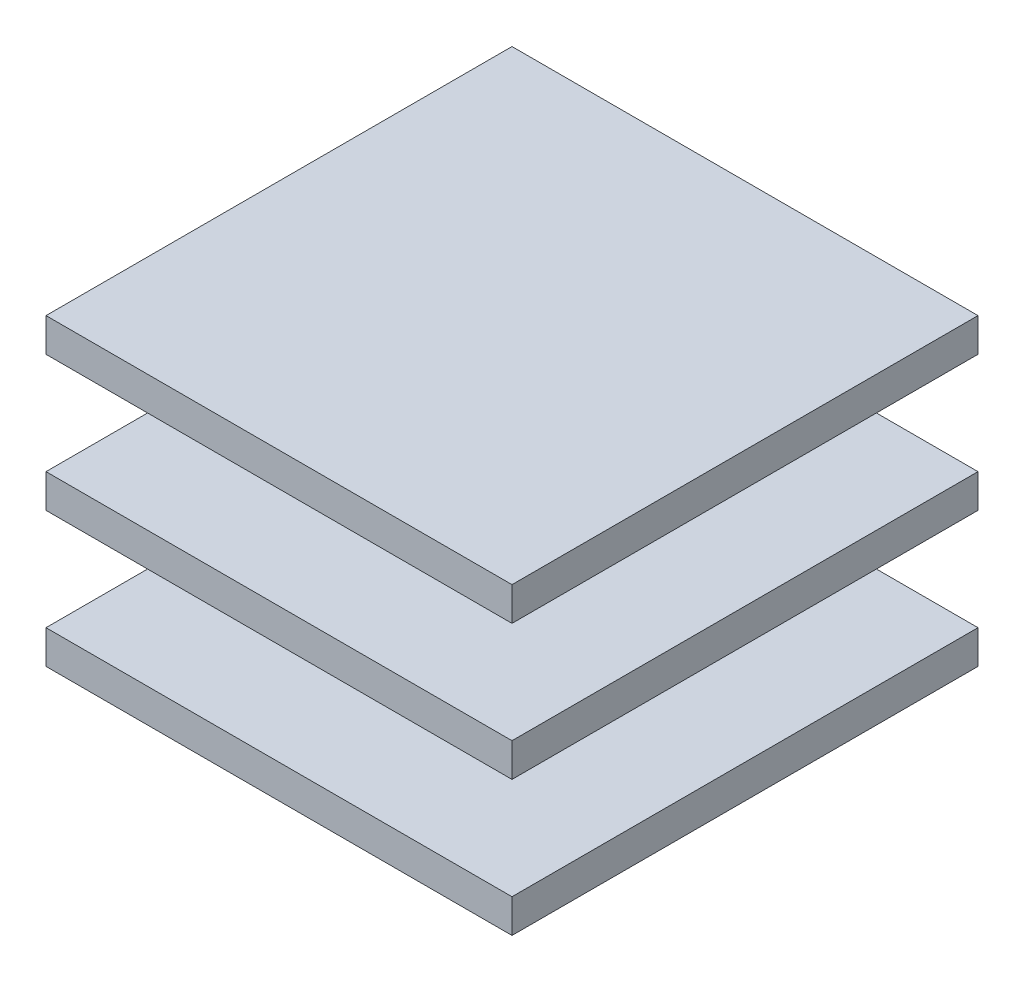
ISO-10303-21;
HEADER;
FILE_DESCRIPTION(('STEP AP214'),'2;1');
FILE_NAME('part.step','',(''),(''),'','','');
FILE_SCHEMA(('AUTOMOTIVE_DESIGN { 1 0 10303 214 1 1 1 1 }'));
ENDSEC;
DATA;
#1=APPLICATION_CONTEXT('core data for automotive mechanical design processes');
#2=APPLICATION_PROTOCOL_DEFINITION('international standard','automotive_design',2000,#1);
#3=PRODUCT_CONTEXT('',#1,'mechanical');
#4=PRODUCT('Part','Part','',(#3));
#5=PRODUCT_RELATED_PRODUCT_CATEGORY('part','',(#4));
#6=PRODUCT_DEFINITION_FORMATION('','',#4);
#7=PRODUCT_DEFINITION_CONTEXT('part definition',#1,'design');
#8=PRODUCT_DEFINITION('design','',#6,#7);
#9=PRODUCT_DEFINITION_SHAPE('','',#8);
#10=(LENGTH_UNIT() NAMED_UNIT(*) SI_UNIT(.MILLI.,.METRE.));
#11=(NAMED_UNIT(*) PLANE_ANGLE_UNIT() SI_UNIT($,.RADIAN.));
#12=(NAMED_UNIT(*) SI_UNIT($,.STERADIAN.) SOLID_ANGLE_UNIT());
#13=UNCERTAINTY_MEASURE_WITH_UNIT(LENGTH_MEASURE(1.E-05),#10,'distance_accuracy_value','');
#14=(GEOMETRIC_REPRESENTATION_CONTEXT(3) GLOBAL_UNCERTAINTY_ASSIGNED_CONTEXT((#13)) GLOBAL_UNIT_ASSIGNED_CONTEXT((#10,
#11,#12)) REPRESENTATION_CONTEXT('',''));
#15=CARTESIAN_POINT('',(0.,0.,0.));
#16=DIRECTION('',(0.,0.,1.));
#17=DIRECTION('',(1.,0.,0.));
#18=AXIS2_PLACEMENT_3D('',#15,#16,#17);
#19=CARTESIAN_POINT('',(0.,90.5,-250.));
#20=DIRECTION('',(0.,-1.,0.));
#21=DIRECTION('',(0.,0.,-1.));
#22=AXIS2_PLACEMENT_3D('',#19,#20,#21);
#23=PLANE('',#22);
#24=DIRECTION('',(0.,0.,1.));
#25=VECTOR('',#24,1.);
#26=CARTESIAN_POINT('',(0.,90.5,0.));
#27=LINE('',#26,#25);
#28=CARTESIAN_POINT('',(0.,90.5,-250.));
#29=VERTEX_POINT('',#28);
#30=CARTESIAN_POINT('',(0.,90.5,0.));
#31=VERTEX_POINT('',#30);
#32=EDGE_CURVE('E228',#29,#31,#27,.T.);
#33=ORIENTED_EDGE('',*,*,#32,.T.);
#34=DIRECTION('',(1.,0.,0.));
#35=VECTOR('',#34,1.);
#36=CARTESIAN_POINT('',(0.,90.5,0.));
#37=LINE('',#36,#35);
#38=CARTESIAN_POINT('',(250.,90.5,0.));
#39=VERTEX_POINT('',#38);
#40=EDGE_CURVE('E231',#31,#39,#37,.T.);
#41=ORIENTED_EDGE('',*,*,#40,.T.);
#42=DIRECTION('',(0.,0.,-1.));
#43=VECTOR('',#42,1.);
#44=CARTESIAN_POINT('',(250.,90.5,0.));
#45=LINE('',#44,#43);
#46=CARTESIAN_POINT('',(250.,90.5,-250.));
#47=VERTEX_POINT('',#46);
#48=EDGE_CURVE('E234',#39,#47,#45,.T.);
#49=ORIENTED_EDGE('',*,*,#48,.T.);
#50=DIRECTION('',(-1.,0.,0.));
#51=VECTOR('',#50,1.);
#52=CARTESIAN_POINT('',(0.,90.5,-250.));
#53=LINE('',#52,#51);
#54=EDGE_CURVE('E236',#47,#29,#53,.T.);
#55=ORIENTED_EDGE('',*,*,#54,.T.);
#56=EDGE_LOOP('',(#33,#41,#49,#55));
#57=FACE_BOUND('',#56,.T.);
#58=DIRECTION('',(0.,0.,1.));
#59=VECTOR('',#58,1.);
#60=CARTESIAN_POINT('',(90.,90.5,-90.));
#61=LINE('',#60,#59);
#62=CARTESIAN_POINT('',(90.,90.5,-160.));
#63=VERTEX_POINT('',#62);
#64=CARTESIAN_POINT('',(90.,90.5,-90.));
#65=VERTEX_POINT('',#64);
#66=EDGE_CURVE('E191',#63,#65,#61,.T.);
#67=ORIENTED_EDGE('',*,*,#66,.F.);
#68=DIRECTION('',(-1.,0.,0.));
#69=VECTOR('',#68,1.);
#70=CARTESIAN_POINT('',(90.,90.5,-160.));
#71=LINE('',#70,#69);
#72=CARTESIAN_POINT('',(160.,90.5,-160.));
#73=VERTEX_POINT('',#72);
#74=EDGE_CURVE('E203',#73,#63,#71,.T.);
#75=ORIENTED_EDGE('',*,*,#74,.F.);
#76=DIRECTION('',(0.,0.,-1.));
#77=VECTOR('',#76,1.);
#78=CARTESIAN_POINT('',(160.,90.5,-90.));
#79=LINE('',#78,#77);
#80=CARTESIAN_POINT('',(160.,90.5,-90.));
#81=VERTEX_POINT('',#80);
#82=EDGE_CURVE('E51',#81,#73,#79,.T.);
#83=ORIENTED_EDGE('',*,*,#82,.F.);
#84=DIRECTION('',(1.,0.,0.));
#85=VECTOR('',#84,1.);
#86=CARTESIAN_POINT('',(90.,90.5,-90.));
#87=LINE('',#86,#85);
#88=EDGE_CURVE('E46',#65,#81,#87,.T.);
#89=ORIENTED_EDGE('',*,*,#88,.F.);
#90=EDGE_LOOP('',(#67,#75,#83,#89));
#91=FACE_BOUND('',#90,.T.);
#92=ADVANCED_FACE('F31',(#57,#91),#23,.F.);
#93=CARTESIAN_POINT('',(0.,18.,-250.));
#94=DIRECTION('',(0.,-1.,0.));
#95=DIRECTION('',(0.,0.,-1.));
#96=AXIS2_PLACEMENT_3D('',#93,#94,#95);
#97=PLANE('',#96);
#98=DIRECTION('',(0.,0.,1.));
#99=VECTOR('',#98,1.);
#100=CARTESIAN_POINT('',(0.,18.,0.));
#101=LINE('',#100,#99);
#102=CARTESIAN_POINT('',(0.,18.,-250.));
#103=VERTEX_POINT('',#102);
#104=CARTESIAN_POINT('',(0.,18.,0.));
#105=VERTEX_POINT('',#104);
#106=EDGE_CURVE('E294',#103,#105,#101,.T.);
#107=ORIENTED_EDGE('',*,*,#106,.T.);
#108=DIRECTION('',(1.,0.,0.));
#109=VECTOR('',#108,1.);
#110=CARTESIAN_POINT('',(0.,18.,0.));
#111=LINE('',#110,#109);
#112=CARTESIAN_POINT('',(250.,18.,0.));
#113=VERTEX_POINT('',#112);
#114=EDGE_CURVE('E297',#105,#113,#111,.T.);
#115=ORIENTED_EDGE('',*,*,#114,.T.);
#116=DIRECTION('',(0.,0.,-1.));
#117=VECTOR('',#116,1.);
#118=CARTESIAN_POINT('',(250.,18.,0.));
#119=LINE('',#118,#117);
#120=CARTESIAN_POINT('',(250.,18.,-250.));
#121=VERTEX_POINT('',#120);
#122=EDGE_CURVE('E300',#113,#121,#119,.T.);
#123=ORIENTED_EDGE('',*,*,#122,.T.);
#124=DIRECTION('',(-1.,0.,0.));
#125=VECTOR('',#124,1.);
#126=CARTESIAN_POINT('',(0.,18.,-250.));
#127=LINE('',#126,#125);
#128=EDGE_CURVE('E302',#121,#103,#127,.T.);
#129=ORIENTED_EDGE('',*,*,#128,.T.);
#130=EDGE_LOOP('',(#107,#115,#123,#129));
#131=FACE_BOUND('',#130,.T.);
#132=DIRECTION('',(0.,0.,1.));
#133=VECTOR('',#132,1.);
#134=CARTESIAN_POINT('',(90.,18.,-90.));
#135=LINE('',#134,#133);
#136=CARTESIAN_POINT('',(90.,18.,-160.));
#137=VERTEX_POINT('',#136);
#138=CARTESIAN_POINT('',(90.,18.,-90.));
#139=VERTEX_POINT('',#138);
#140=EDGE_CURVE('E257',#137,#139,#135,.T.);
#141=ORIENTED_EDGE('',*,*,#140,.F.);
#142=DIRECTION('',(-1.,0.,0.));
#143=VECTOR('',#142,1.);
#144=CARTESIAN_POINT('',(90.,18.,-160.));
#145=LINE('',#144,#143);
#146=CARTESIAN_POINT('',(160.,18.,-160.));
#147=VERTEX_POINT('',#146);
#148=EDGE_CURVE('E262',#147,#137,#145,.T.);
#149=ORIENTED_EDGE('',*,*,#148,.F.);
#150=DIRECTION('',(0.,0.,-1.));
#151=VECTOR('',#150,1.);
#152=CARTESIAN_POINT('',(160.,18.,-90.));
#153=LINE('',#152,#151);
#154=CARTESIAN_POINT('',(160.,18.,-90.));
#155=VERTEX_POINT('',#154);
#156=EDGE_CURVE('E277',#155,#147,#153,.T.);
#157=ORIENTED_EDGE('',*,*,#156,.F.);
#158=DIRECTION('',(1.,0.,0.));
#159=VECTOR('',#158,1.);
#160=CARTESIAN_POINT('',(90.,18.,-90.));
#161=LINE('',#160,#159);
#162=EDGE_CURVE('E274',#139,#155,#161,.T.);
#163=ORIENTED_EDGE('',*,*,#162,.F.);
#164=EDGE_LOOP('',(#141,#149,#157,#163));
#165=FACE_BOUND('',#164,.T.);
#166=ADVANCED_FACE('F336',(#131,#165),#97,.F.);
#167=CARTESIAN_POINT('',(0.,18.,0.));
#168=DIRECTION('',(1.,0.,0.));
#169=DIRECTION('',(0.,0.,-1.));
#170=AXIS2_PLACEMENT_3D('',#167,#168,#169);
#171=PLANE('',#170);
#172=DIRECTION('',(0.,0.,1.));
#173=VECTOR('',#172,1.);
#174=CARTESIAN_POINT('',(0.,0.,0.));
#175=LINE('',#174,#173);
#176=CARTESIAN_POINT('',(0.,0.,-250.));
#177=VERTEX_POINT('',#176);
#178=CARTESIAN_POINT('',(0.,0.,0.));
#179=VERTEX_POINT('',#178);
#180=EDGE_CURVE('E293',#177,#179,#175,.T.);
#181=ORIENTED_EDGE('',*,*,#180,.T.);
#182=DIRECTION('',(0.,-1.,0.));
#183=VECTOR('',#182,1.);
#184=CARTESIAN_POINT('',(0.,18.,0.));
#185=LINE('',#184,#183);
#186=EDGE_CURVE('E11',#105,#179,#185,.T.);
#187=ORIENTED_EDGE('',*,*,#186,.F.);
#188=ORIENTED_EDGE('',*,*,#106,.F.);
#189=DIRECTION('',(0.,-1.,0.));
#190=VECTOR('',#189,1.);
#191=CARTESIAN_POINT('',(0.,18.,-250.));
#192=LINE('',#191,#190);
#193=EDGE_CURVE('E304',#103,#177,#192,.T.);
#194=ORIENTED_EDGE('',*,*,#193,.T.);
#195=EDGE_LOOP('',(#181,#187,#188,#194));
#196=FACE_BOUND('',#195,.T.);
#197=ADVANCED_FACE('F33',(#196),#171,.F.);
#198=CARTESIAN_POINT('',(0.,18.,0.));
#199=DIRECTION('',(0.,0.,-1.));
#200=DIRECTION('',(-1.,0.,0.));
#201=AXIS2_PLACEMENT_3D('',#198,#199,#200);
#202=PLANE('',#201);
#203=DIRECTION('',(1.,0.,0.));
#204=VECTOR('',#203,1.);
#205=CARTESIAN_POINT('',(0.,0.,0.));
#206=LINE('',#205,#204);
#207=CARTESIAN_POINT('',(250.,0.,0.));
#208=VERTEX_POINT('',#207);
#209=EDGE_CURVE('E307',#179,#208,#206,.T.);
#210=ORIENTED_EDGE('',*,*,#209,.T.);
#211=DIRECTION('',(0.,-1.,0.));
#212=VECTOR('',#211,1.);
#213=CARTESIAN_POINT('',(250.,18.,0.));
#214=LINE('',#213,#212);
#215=EDGE_CURVE('E39',#113,#208,#214,.T.);
#216=ORIENTED_EDGE('',*,*,#215,.F.);
#217=ORIENTED_EDGE('',*,*,#114,.F.);
#218=ORIENTED_EDGE('',*,*,#186,.T.);
#219=EDGE_LOOP('',(#210,#216,#217,#218));
#220=FACE_BOUND('',#219,.T.);
#221=ADVANCED_FACE('F338',(#220),#202,.F.);
#222=CARTESIAN_POINT('',(250.,18.,0.));
#223=DIRECTION('',(-1.,0.,0.));
#224=DIRECTION('',(0.,0.,1.));
#225=AXIS2_PLACEMENT_3D('',#222,#223,#224);
#226=PLANE('',#225);
#227=DIRECTION('',(0.,0.,-1.));
#228=VECTOR('',#227,1.);
#229=CARTESIAN_POINT('',(250.,0.,0.));
#230=LINE('',#229,#228);
#231=CARTESIAN_POINT('',(250.,0.,-250.));
#232=VERTEX_POINT('',#231);
#233=EDGE_CURVE('E309',#208,#232,#230,.T.);
#234=ORIENTED_EDGE('',*,*,#233,.T.);
#235=DIRECTION('',(0.,-1.,0.));
#236=VECTOR('',#235,1.);
#237=CARTESIAN_POINT('',(250.,18.,-250.));
#238=LINE('',#237,#236);
#239=EDGE_CURVE('E314',#121,#232,#238,.T.);
#240=ORIENTED_EDGE('',*,*,#239,.F.);
#241=ORIENTED_EDGE('',*,*,#122,.F.);
#242=ORIENTED_EDGE('',*,*,#215,.T.);
#243=EDGE_LOOP('',(#234,#240,#241,#242));
#244=FACE_BOUND('',#243,.T.);
#245=ADVANCED_FACE('F321',(#244),#226,.F.);
#246=CARTESIAN_POINT('',(0.,18.,-250.));
#247=DIRECTION('',(0.,0.,1.));
#248=DIRECTION('',(1.,0.,0.));
#249=AXIS2_PLACEMENT_3D('',#246,#247,#248);
#250=PLANE('',#249);
#251=DIRECTION('',(-1.,0.,0.));
#252=VECTOR('',#251,1.);
#253=CARTESIAN_POINT('',(0.,0.,-250.));
#254=LINE('',#253,#252);
#255=EDGE_CURVE('E298',#232,#177,#254,.T.);
#256=ORIENTED_EDGE('',*,*,#255,.T.);
#257=ORIENTED_EDGE('',*,*,#193,.F.);
#258=ORIENTED_EDGE('',*,*,#128,.F.);
#259=ORIENTED_EDGE('',*,*,#239,.T.);
#260=EDGE_LOOP('',(#256,#257,#258,#259));
#261=FACE_BOUND('',#260,.T.);
#262=ADVANCED_FACE('F330',(#261),#250,.F.);
#263=CARTESIAN_POINT('',(0.,0.,-250.));
#264=DIRECTION('',(0.,-1.,0.));
#265=DIRECTION('',(0.,0.,-1.));
#266=AXIS2_PLACEMENT_3D('',#263,#264,#265);
#267=PLANE('',#266);
#268=ORIENTED_EDGE('',*,*,#180,.F.);
#269=ORIENTED_EDGE('',*,*,#255,.F.);
#270=ORIENTED_EDGE('',*,*,#233,.F.);
#271=ORIENTED_EDGE('',*,*,#209,.F.);
#272=EDGE_LOOP('',(#268,#269,#270,#271));
#273=FACE_BOUND('',#272,.T.);
#274=ADVANCED_FACE('F327',(#273),#267,.T.);
#275=CARTESIAN_POINT('',(90.,72.5,-90.));
#276=DIRECTION('',(1.,0.,0.));
#277=DIRECTION('',(0.,0.,-1.));
#278=AXIS2_PLACEMENT_3D('',#275,#276,#277);
#279=PLANE('',#278);
#280=ORIENTED_EDGE('',*,*,#140,.T.);
#281=DIRECTION('',(0.,-1.,0.));
#282=VECTOR('',#281,1.);
#283=CARTESIAN_POINT('',(90.,72.5,-90.));
#284=LINE('',#283,#282);
#285=CARTESIAN_POINT('',(90.,72.5,-90.));
#286=VERTEX_POINT('',#285);
#287=EDGE_CURVE('E290',#286,#139,#284,.T.);
#288=ORIENTED_EDGE('',*,*,#287,.F.);
#289=DIRECTION('',(0.,0.,1.));
#290=VECTOR('',#289,1.);
#291=CARTESIAN_POINT('',(90.,72.5,-90.));
#292=LINE('',#291,#290);
#293=CARTESIAN_POINT('',(90.,72.5,-160.));
#294=VERTEX_POINT('',#293);
#295=EDGE_CURVE('E258',#294,#286,#292,.T.);
#296=ORIENTED_EDGE('',*,*,#295,.F.);
#297=DIRECTION('',(0.,-1.,0.));
#298=VECTOR('',#297,1.);
#299=CARTESIAN_POINT('',(90.,72.5,-160.));
#300=LINE('',#299,#298);
#301=EDGE_CURVE('E271',#294,#137,#300,.T.);
#302=ORIENTED_EDGE('',*,*,#301,.T.);
#303=EDGE_LOOP('',(#280,#288,#296,#302));
#304=FACE_BOUND('',#303,.T.);
#305=ADVANCED_FACE('F387',(#304),#279,.F.);
#306=CARTESIAN_POINT('',(90.,72.5,-90.));
#307=DIRECTION('',(0.,0.,-1.));
#308=DIRECTION('',(-1.,0.,0.));
#309=AXIS2_PLACEMENT_3D('',#306,#307,#308);
#310=PLANE('',#309);
#311=ORIENTED_EDGE('',*,*,#162,.T.);
#312=DIRECTION('',(0.,-1.,0.));
#313=VECTOR('',#312,1.);
#314=CARTESIAN_POINT('',(160.,72.5,-90.));
#315=LINE('',#314,#313);
#316=CARTESIAN_POINT('',(160.,72.5,-90.));
#317=VERTEX_POINT('',#316);
#318=EDGE_CURVE('E287',#317,#155,#315,.T.);
#319=ORIENTED_EDGE('',*,*,#318,.F.);
#320=DIRECTION('',(1.,0.,0.));
#321=VECTOR('',#320,1.);
#322=CARTESIAN_POINT('',(90.,72.5,-90.));
#323=LINE('',#322,#321);
#324=EDGE_CURVE('E261',#286,#317,#323,.T.);
#325=ORIENTED_EDGE('',*,*,#324,.F.);
#326=ORIENTED_EDGE('',*,*,#287,.T.);
#327=EDGE_LOOP('',(#311,#319,#325,#326));
#328=FACE_BOUND('',#327,.T.);
#329=ADVANCED_FACE('F383',(#328),#310,.F.);
#330=CARTESIAN_POINT('',(160.,72.5,-90.));
#331=DIRECTION('',(-1.,0.,0.));
#332=DIRECTION('',(0.,0.,1.));
#333=AXIS2_PLACEMENT_3D('',#330,#331,#332);
#334=PLANE('',#333);
#335=ORIENTED_EDGE('',*,*,#156,.T.);
#336=DIRECTION('',(0.,-1.,0.));
#337=VECTOR('',#336,1.);
#338=CARTESIAN_POINT('',(160.,72.5,-160.));
#339=LINE('',#338,#337);
#340=CARTESIAN_POINT('',(160.,72.5,-160.));
#341=VERTEX_POINT('',#340);
#342=EDGE_CURVE('E284',#341,#147,#339,.T.);
#343=ORIENTED_EDGE('',*,*,#342,.F.);
#344=DIRECTION('',(0.,0.,-1.));
#345=VECTOR('',#344,1.);
#346=CARTESIAN_POINT('',(160.,72.5,-90.));
#347=LINE('',#346,#345);
#348=EDGE_CURVE('E265',#317,#341,#347,.T.);
#349=ORIENTED_EDGE('',*,*,#348,.F.);
#350=ORIENTED_EDGE('',*,*,#318,.T.);
#351=EDGE_LOOP('',(#335,#343,#349,#350));
#352=FACE_BOUND('',#351,.T.);
#353=ADVANCED_FACE('F379',(#352),#334,.F.);
#354=CARTESIAN_POINT('',(90.,72.5,-160.));
#355=DIRECTION('',(0.,0.,1.));
#356=DIRECTION('',(1.,0.,0.));
#357=AXIS2_PLACEMENT_3D('',#354,#355,#356);
#358=PLANE('',#357);
#359=ORIENTED_EDGE('',*,*,#148,.T.);
#360=ORIENTED_EDGE('',*,*,#301,.F.);
#361=DIRECTION('',(-1.,0.,0.));
#362=VECTOR('',#361,1.);
#363=CARTESIAN_POINT('',(90.,72.5,-160.));
#364=LINE('',#363,#362);
#365=EDGE_CURVE('E268',#341,#294,#364,.T.);
#366=ORIENTED_EDGE('',*,*,#365,.F.);
#367=ORIENTED_EDGE('',*,*,#342,.T.);
#368=EDGE_LOOP('',(#359,#360,#366,#367));
#369=FACE_BOUND('',#368,.T.);
#370=ADVANCED_FACE('F360',(#369),#358,.F.);
#371=CARTESIAN_POINT('',(0.,72.5,-250.));
#372=DIRECTION('',(0.,-1.,0.));
#373=DIRECTION('',(0.,0.,-1.));
#374=AXIS2_PLACEMENT_3D('',#371,#372,#373);
#375=PLANE('',#374);
#376=DIRECTION('',(0.,0.,1.));
#377=VECTOR('',#376,1.);
#378=CARTESIAN_POINT('',(0.,72.5,0.));
#379=LINE('',#378,#377);
#380=CARTESIAN_POINT('',(0.,72.5,-250.));
#381=VERTEX_POINT('',#380);
#382=CARTESIAN_POINT('',(0.,72.5,0.));
#383=VERTEX_POINT('',#382);
#384=EDGE_CURVE('E227',#381,#383,#379,.T.);
#385=ORIENTED_EDGE('',*,*,#384,.F.);
#386=DIRECTION('',(-1.,0.,0.));
#387=VECTOR('',#386,1.);
#388=CARTESIAN_POINT('',(0.,72.5,-250.));
#389=LINE('',#388,#387);
#390=CARTESIAN_POINT('',(250.,72.5,-250.));
#391=VERTEX_POINT('',#390);
#392=EDGE_CURVE('E232',#391,#381,#389,.T.);
#393=ORIENTED_EDGE('',*,*,#392,.F.);
#394=DIRECTION('',(0.,0.,-1.));
#395=VECTOR('',#394,1.);
#396=CARTESIAN_POINT('',(250.,72.5,0.));
#397=LINE('',#396,#395);
#398=CARTESIAN_POINT('',(250.,72.5,0.));
#399=VERTEX_POINT('',#398);
#400=EDGE_CURVE('E243',#399,#391,#397,.T.);
#401=ORIENTED_EDGE('',*,*,#400,.F.);
#402=DIRECTION('',(1.,0.,0.));
#403=VECTOR('',#402,1.);
#404=CARTESIAN_POINT('',(0.,72.5,0.));
#405=LINE('',#404,#403);
#406=EDGE_CURVE('E241',#383,#399,#405,.T.);
#407=ORIENTED_EDGE('',*,*,#406,.F.);
#408=EDGE_LOOP('',(#385,#393,#401,#407));
#409=FACE_BOUND('',#408,.T.);
#410=ORIENTED_EDGE('',*,*,#295,.T.);
#411=ORIENTED_EDGE('',*,*,#324,.T.);
#412=ORIENTED_EDGE('',*,*,#348,.T.);
#413=ORIENTED_EDGE('',*,*,#365,.T.);
#414=EDGE_LOOP('',(#410,#411,#412,#413));
#415=FACE_BOUND('',#414,.T.);
#416=ADVANCED_FACE('F356',(#409,#415),#375,.T.);
#417=CARTESIAN_POINT('',(0.,90.5,0.));
#418=DIRECTION('',(1.,0.,0.));
#419=DIRECTION('',(0.,0.,-1.));
#420=AXIS2_PLACEMENT_3D('',#417,#418,#419);
#421=PLANE('',#420);
#422=ORIENTED_EDGE('',*,*,#384,.T.);
#423=DIRECTION('',(0.,-1.,0.));
#424=VECTOR('',#423,1.);
#425=CARTESIAN_POINT('',(0.,90.5,0.));
#426=LINE('',#425,#424);
#427=EDGE_CURVE('E254',#31,#383,#426,.T.);
#428=ORIENTED_EDGE('',*,*,#427,.F.);
#429=ORIENTED_EDGE('',*,*,#32,.F.);
#430=DIRECTION('',(0.,-1.,0.));
#431=VECTOR('',#430,1.);
#432=CARTESIAN_POINT('',(0.,90.5,-250.));
#433=LINE('',#432,#431);
#434=EDGE_CURVE('E238',#29,#381,#433,.T.);
#435=ORIENTED_EDGE('',*,*,#434,.T.);
#436=EDGE_LOOP('',(#422,#428,#429,#435));
#437=FACE_BOUND('',#436,.T.);
#438=ADVANCED_FACE('F359',(#437),#421,.F.);
#439=CARTESIAN_POINT('',(0.,90.5,0.));
#440=DIRECTION('',(0.,0.,-1.));
#441=DIRECTION('',(-1.,0.,0.));
#442=AXIS2_PLACEMENT_3D('',#439,#440,#441);
#443=PLANE('',#442);
#444=ORIENTED_EDGE('',*,*,#406,.T.);
#445=DIRECTION('',(0.,-1.,0.));
#446=VECTOR('',#445,1.);
#447=CARTESIAN_POINT('',(250.,90.5,0.));
#448=LINE('',#447,#446);
#449=EDGE_CURVE('E251',#39,#399,#448,.T.);
#450=ORIENTED_EDGE('',*,*,#449,.F.);
#451=ORIENTED_EDGE('',*,*,#40,.F.);
#452=ORIENTED_EDGE('',*,*,#427,.T.);
#453=EDGE_LOOP('',(#444,#450,#451,#452));
#454=FACE_BOUND('',#453,.T.);
#455=ADVANCED_FACE('F369',(#454),#443,.F.);
#456=CARTESIAN_POINT('',(250.,90.5,0.));
#457=DIRECTION('',(-1.,0.,0.));
#458=DIRECTION('',(0.,0.,1.));
#459=AXIS2_PLACEMENT_3D('',#456,#457,#458);
#460=PLANE('',#459);
#461=ORIENTED_EDGE('',*,*,#400,.T.);
#462=DIRECTION('',(0.,-1.,0.));
#463=VECTOR('',#462,1.);
#464=CARTESIAN_POINT('',(250.,90.5,-250.));
#465=LINE('',#464,#463);
#466=EDGE_CURVE('E248',#47,#391,#465,.T.);
#467=ORIENTED_EDGE('',*,*,#466,.F.);
#468=ORIENTED_EDGE('',*,*,#48,.F.);
#469=ORIENTED_EDGE('',*,*,#449,.T.);
#470=EDGE_LOOP('',(#461,#467,#468,#469));
#471=FACE_BOUND('',#470,.T.);
#472=ADVANCED_FACE('F365',(#471),#460,.F.);
#473=CARTESIAN_POINT('',(0.,90.5,-250.));
#474=DIRECTION('',(0.,0.,1.));
#475=DIRECTION('',(1.,0.,0.));
#476=AXIS2_PLACEMENT_3D('',#473,#474,#475);
#477=PLANE('',#476);
#478=ORIENTED_EDGE('',*,*,#392,.T.);
#479=ORIENTED_EDGE('',*,*,#434,.F.);
#480=ORIENTED_EDGE('',*,*,#54,.F.);
#481=ORIENTED_EDGE('',*,*,#466,.T.);
#482=EDGE_LOOP('',(#478,#479,#480,#481));
#483=FACE_BOUND('',#482,.T.);
#484=ADVANCED_FACE('F362',(#483),#477,.F.);
#485=CARTESIAN_POINT('',(90.,145.,-90.));
#486=DIRECTION('',(1.,0.,0.));
#487=DIRECTION('',(0.,0.,-1.));
#488=AXIS2_PLACEMENT_3D('',#485,#486,#487);
#489=PLANE('',#488);
#490=ORIENTED_EDGE('',*,*,#66,.T.);
#491=DIRECTION('',(0.,-1.,0.));
#492=VECTOR('',#491,1.);
#493=CARTESIAN_POINT('',(90.,145.,-90.));
#494=LINE('',#493,#492);
#495=CARTESIAN_POINT('',(90.,145.,-90.));
#496=VERTEX_POINT('',#495);
#497=EDGE_CURVE('E225',#496,#65,#494,.T.);
#498=ORIENTED_EDGE('',*,*,#497,.F.);
#499=DIRECTION('',(0.,0.,1.));
#500=VECTOR('',#499,1.);
#501=CARTESIAN_POINT('',(90.,145.,-90.));
#502=LINE('',#501,#500);
#503=CARTESIAN_POINT('',(90.,145.,-160.));
#504=VERTEX_POINT('',#503);
#505=EDGE_CURVE('E199',#504,#496,#502,.T.);
#506=ORIENTED_EDGE('',*,*,#505,.F.);
#507=DIRECTION('',(0.,-1.,0.));
#508=VECTOR('',#507,1.);
#509=CARTESIAN_POINT('',(90.,145.,-160.));
#510=LINE('',#509,#508);
#511=EDGE_CURVE('E211',#504,#63,#510,.T.);
#512=ORIENTED_EDGE('',*,*,#511,.T.);
#513=EDGE_LOOP('',(#490,#498,#506,#512));
#514=FACE_BOUND('',#513,.T.);
#515=ADVANCED_FACE('F354',(#514),#489,.F.);
#516=CARTESIAN_POINT('',(90.,145.,-90.));
#517=DIRECTION('',(0.,0.,-1.));
#518=DIRECTION('',(-1.,0.,0.));
#519=AXIS2_PLACEMENT_3D('',#516,#517,#518);
#520=PLANE('',#519);
#521=ORIENTED_EDGE('',*,*,#88,.T.);
#522=DIRECTION('',(0.,-1.,0.));
#523=VECTOR('',#522,1.);
#524=CARTESIAN_POINT('',(160.,145.,-90.));
#525=LINE('',#524,#523);
#526=CARTESIAN_POINT('',(160.,145.,-90.));
#527=VERTEX_POINT('',#526);
#528=EDGE_CURVE('E222',#527,#81,#525,.T.);
#529=ORIENTED_EDGE('',*,*,#528,.F.);
#530=DIRECTION('',(1.,0.,0.));
#531=VECTOR('',#530,1.);
#532=CARTESIAN_POINT('',(90.,145.,-90.));
#533=LINE('',#532,#531);
#534=EDGE_CURVE('E202',#496,#527,#533,.T.);
#535=ORIENTED_EDGE('',*,*,#534,.F.);
#536=ORIENTED_EDGE('',*,*,#497,.T.);
#537=EDGE_LOOP('',(#521,#529,#535,#536));
#538=FACE_BOUND('',#537,.T.);
#539=ADVANCED_FACE('F446',(#538),#520,.F.);
#540=CARTESIAN_POINT('',(160.,145.,-90.));
#541=DIRECTION('',(-1.,0.,0.));
#542=DIRECTION('',(0.,0.,1.));
#543=AXIS2_PLACEMENT_3D('',#540,#541,#542);
#544=PLANE('',#543);
#545=ORIENTED_EDGE('',*,*,#82,.T.);
#546=DIRECTION('',(0.,-1.,0.));
#547=VECTOR('',#546,1.);
#548=CARTESIAN_POINT('',(160.,145.,-160.));
#549=LINE('',#548,#547);
#550=CARTESIAN_POINT('',(160.,145.,-160.));
#551=VERTEX_POINT('',#550);
#552=EDGE_CURVE('E219',#551,#73,#549,.T.);
#553=ORIENTED_EDGE('',*,*,#552,.F.);
#554=DIRECTION('',(0.,0.,-1.));
#555=VECTOR('',#554,1.);
#556=CARTESIAN_POINT('',(160.,145.,-90.));
#557=LINE('',#556,#555);
#558=EDGE_CURVE('E206',#527,#551,#557,.T.);
#559=ORIENTED_EDGE('',*,*,#558,.F.);
#560=ORIENTED_EDGE('',*,*,#528,.T.);
#561=EDGE_LOOP('',(#545,#553,#559,#560));
#562=FACE_BOUND('',#561,.T.);
#563=ADVANCED_FACE('F453',(#562),#544,.F.);
#564=CARTESIAN_POINT('',(90.,145.,-160.));
#565=DIRECTION('',(0.,0.,1.));
#566=DIRECTION('',(1.,0.,0.));
#567=AXIS2_PLACEMENT_3D('',#564,#565,#566);
#568=PLANE('',#567);
#569=ORIENTED_EDGE('',*,*,#74,.T.);
#570=ORIENTED_EDGE('',*,*,#511,.F.);
#571=DIRECTION('',(-1.,0.,0.));
#572=VECTOR('',#571,1.);
#573=CARTESIAN_POINT('',(90.,145.,-160.));
#574=LINE('',#573,#572);
#575=EDGE_CURVE('E209',#551,#504,#574,.T.);
#576=ORIENTED_EDGE('',*,*,#575,.F.);
#577=ORIENTED_EDGE('',*,*,#552,.T.);
#578=EDGE_LOOP('',(#569,#570,#576,#577));
#579=FACE_BOUND('',#578,.T.);
#580=ADVANCED_FACE('F460',(#579),#568,.F.);
#581=CARTESIAN_POINT('',(0.,145.,-250.));
#582=DIRECTION('',(0.,-1.,0.));
#583=DIRECTION('',(0.,0.,-1.));
#584=AXIS2_PLACEMENT_3D('',#581,#582,#583);
#585=PLANE('',#584);
#586=DIRECTION('',(0.,0.,1.));
#587=VECTOR('',#586,1.);
#588=CARTESIAN_POINT('',(0.,145.,0.));
#589=LINE('',#588,#587);
#590=CARTESIAN_POINT('',(0.,145.,-250.));
#591=VERTEX_POINT('',#590);
#592=CARTESIAN_POINT('',(0.,145.,0.));
#593=VERTEX_POINT('',#592);
#594=EDGE_CURVE('E190',#591,#593,#589,.T.);
#595=ORIENTED_EDGE('',*,*,#594,.F.);
#596=DIRECTION('',(-1.,0.,0.));
#597=VECTOR('',#596,1.);
#598=CARTESIAN_POINT('',(0.,145.,-250.));
#599=LINE('',#598,#597);
#600=CARTESIAN_POINT('',(250.,145.,-250.));
#601=VERTEX_POINT('',#600);
#602=EDGE_CURVE('E186',#601,#591,#599,.T.);
#603=ORIENTED_EDGE('',*,*,#602,.F.);
#604=DIRECTION('',(0.,0.,-1.));
#605=VECTOR('',#604,1.);
#606=CARTESIAN_POINT('',(250.,145.,0.));
#607=LINE('',#606,#605);
#608=CARTESIAN_POINT('',(250.,145.,0.));
#609=VERTEX_POINT('',#608);
#610=EDGE_CURVE('E583',#609,#601,#607,.T.);
#611=ORIENTED_EDGE('',*,*,#610,.F.);
#612=DIRECTION('',(1.,0.,0.));
#613=VECTOR('',#612,1.);
#614=CARTESIAN_POINT('',(0.,145.,0.));
#615=LINE('',#614,#613);
#616=EDGE_CURVE('E587',#593,#609,#615,.T.);
#617=ORIENTED_EDGE('',*,*,#616,.F.);
#618=EDGE_LOOP('',(#595,#603,#611,#617));
#619=FACE_BOUND('',#618,.T.);
#620=ORIENTED_EDGE('',*,*,#505,.T.);
#621=ORIENTED_EDGE('',*,*,#534,.T.);
#622=ORIENTED_EDGE('',*,*,#558,.T.);
#623=ORIENTED_EDGE('',*,*,#575,.T.);
#624=EDGE_LOOP('',(#620,#621,#622,#623));
#625=FACE_BOUND('',#624,.T.);
#626=ADVANCED_FACE('F468',(#619,#625),#585,.T.);
#627=CARTESIAN_POINT('',(0.,163.,0.));
#628=DIRECTION('',(1.,0.,0.));
#629=DIRECTION('',(0.,0.,-1.));
#630=AXIS2_PLACEMENT_3D('',#627,#628,#629);
#631=PLANE('',#630);
#632=ORIENTED_EDGE('',*,*,#594,.T.);
#633=DIRECTION('',(0.,-1.,0.));
#634=VECTOR('',#633,1.);
#635=CARTESIAN_POINT('',(0.,163.,0.));
#636=LINE('',#635,#634);
#637=CARTESIAN_POINT('',(0.,163.,0.));
#638=VERTEX_POINT('',#637);
#639=EDGE_CURVE('E170',#638,#593,#636,.T.);
#640=ORIENTED_EDGE('',*,*,#639,.F.);
#641=DIRECTION('',(0.,0.,1.));
#642=VECTOR('',#641,1.);
#643=CARTESIAN_POINT('',(0.,163.,0.));
#644=LINE('',#643,#642);
#645=CARTESIAN_POINT('',(0.,163.,-250.));
#646=VERTEX_POINT('',#645);
#647=EDGE_CURVE('E177',#646,#638,#644,.T.);
#648=ORIENTED_EDGE('',*,*,#647,.F.);
#649=DIRECTION('',(0.,-1.,0.));
#650=VECTOR('',#649,1.);
#651=CARTESIAN_POINT('',(0.,163.,-250.));
#652=LINE('',#651,#650);
#653=EDGE_CURVE('E580',#646,#591,#652,.T.);
#654=ORIENTED_EDGE('',*,*,#653,.T.);
#655=EDGE_LOOP('',(#632,#640,#648,#654));
#656=FACE_BOUND('',#655,.T.);
#657=ADVANCED_FACE('F188',(#656),#631,.F.);
#658=CARTESIAN_POINT('',(0.,163.,0.));
#659=DIRECTION('',(0.,0.,-1.));
#660=DIRECTION('',(-1.,0.,0.));
#661=AXIS2_PLACEMENT_3D('',#658,#659,#660);
#662=PLANE('',#661);
#663=ORIENTED_EDGE('',*,*,#616,.T.);
#664=DIRECTION('',(0.,-1.,0.));
#665=VECTOR('',#664,1.);
#666=CARTESIAN_POINT('',(250.,163.,0.));
#667=LINE('',#666,#665);
#668=CARTESIAN_POINT('',(250.,163.,0.));
#669=VERTEX_POINT('',#668);
#670=EDGE_CURVE('E173',#669,#609,#667,.T.);
#671=ORIENTED_EDGE('',*,*,#670,.F.);
#672=DIRECTION('',(1.,0.,0.));
#673=VECTOR('',#672,1.);
#674=CARTESIAN_POINT('',(0.,163.,0.));
#675=LINE('',#674,#673);
#676=EDGE_CURVE('E166',#638,#669,#675,.T.);
#677=ORIENTED_EDGE('',*,*,#676,.F.);
#678=ORIENTED_EDGE('',*,*,#639,.T.);
#679=EDGE_LOOP('',(#663,#671,#677,#678));
#680=FACE_BOUND('',#679,.T.);
#681=ADVANCED_FACE('F168',(#680),#662,.F.);
#682=CARTESIAN_POINT('',(250.,163.,0.));
#683=DIRECTION('',(-1.,0.,0.));
#684=DIRECTION('',(0.,0.,1.));
#685=AXIS2_PLACEMENT_3D('',#682,#683,#684);
#686=PLANE('',#685);
#687=ORIENTED_EDGE('',*,*,#610,.T.);
#688=DIRECTION('',(0.,-1.,0.));
#689=VECTOR('',#688,1.);
#690=CARTESIAN_POINT('',(250.,163.,-250.));
#691=LINE('',#690,#689);
#692=CARTESIAN_POINT('',(250.,163.,-250.));
#693=VERTEX_POINT('',#692);
#694=EDGE_CURVE('E195',#693,#601,#691,.T.);
#695=ORIENTED_EDGE('',*,*,#694,.F.);
#696=DIRECTION('',(0.,0.,-1.));
#697=VECTOR('',#696,1.);
#698=CARTESIAN_POINT('',(250.,163.,0.));
#699=LINE('',#698,#697);
#700=EDGE_CURVE('E176',#669,#693,#699,.T.);
#701=ORIENTED_EDGE('',*,*,#700,.F.);
#702=ORIENTED_EDGE('',*,*,#670,.T.);
#703=EDGE_LOOP('',(#687,#695,#701,#702));
#704=FACE_BOUND('',#703,.T.);
#705=ADVANCED_FACE('F489',(#704),#686,.F.);
#706=CARTESIAN_POINT('',(0.,163.,-250.));
#707=DIRECTION('',(0.,0.,1.));
#708=DIRECTION('',(1.,0.,0.));
#709=AXIS2_PLACEMENT_3D('',#706,#707,#708);
#710=PLANE('',#709);
#711=ORIENTED_EDGE('',*,*,#602,.T.);
#712=ORIENTED_EDGE('',*,*,#653,.F.);
#713=DIRECTION('',(-1.,0.,0.));
#714=VECTOR('',#713,1.);
#715=CARTESIAN_POINT('',(0.,163.,-250.));
#716=LINE('',#715,#714);
#717=EDGE_CURVE('E182',#693,#646,#716,.T.);
#718=ORIENTED_EDGE('',*,*,#717,.F.);
#719=ORIENTED_EDGE('',*,*,#694,.T.);
#720=EDGE_LOOP('',(#711,#712,#718,#719));
#721=FACE_BOUND('',#720,.T.);
#722=ADVANCED_FACE('F496',(#721),#710,.F.);
#723=CARTESIAN_POINT('',(0.,163.,-250.));
#724=DIRECTION('',(0.,-1.,0.));
#725=DIRECTION('',(0.,0.,-1.));
#726=AXIS2_PLACEMENT_3D('',#723,#724,#725);
#727=PLANE('',#726);
#728=ORIENTED_EDGE('',*,*,#647,.T.);
#729=ORIENTED_EDGE('',*,*,#676,.T.);
#730=ORIENTED_EDGE('',*,*,#700,.T.);
#731=ORIENTED_EDGE('',*,*,#717,.T.);
#732=EDGE_LOOP('',(#728,#729,#730,#731));
#733=FACE_BOUND('',#732,.T.);
#734=ADVANCED_FACE('F180',(#733),#727,.F.);
#735=CLOSED_SHELL('',(#92,#166,#197,#221,#245,#262,#274,#305,#329,#353,#370,#416,#438,#455,#472,
#484,#515,#539,#563,#580,#626,#657,#681,#705,#722,#734));
#736=MANIFOLD_SOLID_BREP('B2',#735);
#737=ADVANCED_BREP_SHAPE_REPRESENTATION('',(#18,#736),#14);
#738=SHAPE_DEFINITION_REPRESENTATION(#9,#737);
ENDSEC;
END-ISO-10303-21;
